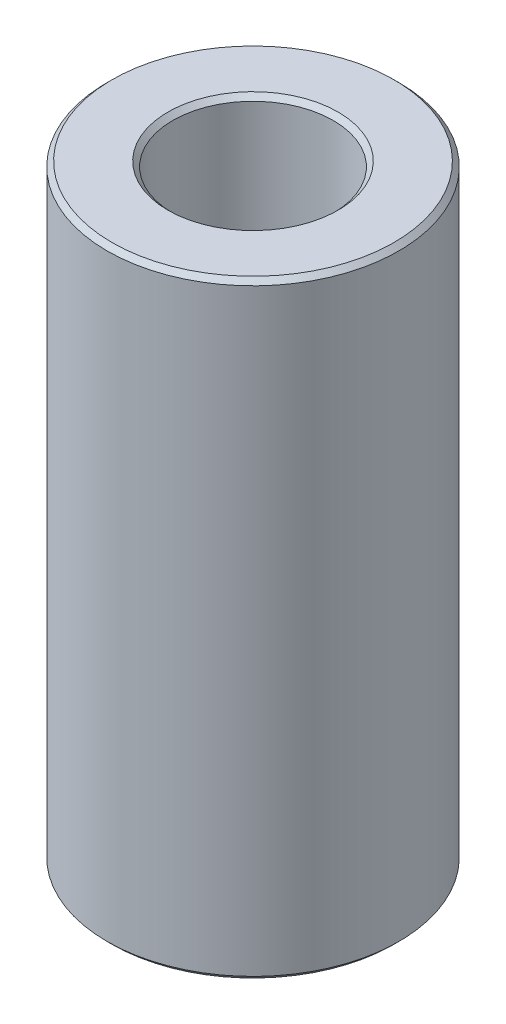
ISO-10303-21;
HEADER;
FILE_DESCRIPTION(('STEP AP214'),'2;1');
FILE_NAME('part.step','',(''),(''),'','','');
FILE_SCHEMA(('AUTOMOTIVE_DESIGN { 1 0 10303 214 1 1 1 1 }'));
ENDSEC;
DATA;
#1=APPLICATION_CONTEXT('core data for automotive mechanical design processes');
#2=APPLICATION_PROTOCOL_DEFINITION('international standard','automotive_design',2000,#1);
#3=PRODUCT_CONTEXT('',#1,'mechanical');
#4=PRODUCT('Part','Part','',(#3));
#5=PRODUCT_RELATED_PRODUCT_CATEGORY('part','',(#4));
#6=PRODUCT_DEFINITION_FORMATION('','',#4);
#7=PRODUCT_DEFINITION_CONTEXT('part definition',#1,'design');
#8=PRODUCT_DEFINITION('design','',#6,#7);
#9=PRODUCT_DEFINITION_SHAPE('','',#8);
#10=(LENGTH_UNIT() NAMED_UNIT(*) SI_UNIT(.MILLI.,.METRE.));
#11=(NAMED_UNIT(*) PLANE_ANGLE_UNIT() SI_UNIT($,.RADIAN.));
#12=(NAMED_UNIT(*) SI_UNIT($,.STERADIAN.) SOLID_ANGLE_UNIT());
#13=UNCERTAINTY_MEASURE_WITH_UNIT(LENGTH_MEASURE(1.E-05),#10,'distance_accuracy_value','');
#14=(GEOMETRIC_REPRESENTATION_CONTEXT(3) GLOBAL_UNCERTAINTY_ASSIGNED_CONTEXT((#13)) GLOBAL_UNIT_ASSIGNED_CONTEXT((#10,
#11,#12)) REPRESENTATION_CONTEXT('',''));
#15=CARTESIAN_POINT('',(0.,0.,0.));
#16=DIRECTION('',(0.,0.,1.));
#17=DIRECTION('',(1.,0.,0.));
#18=AXIS2_PLACEMENT_3D('',#15,#16,#17);
#19=CARTESIAN_POINT('',(0.,25.,0.));
#20=DIRECTION('',(0.,-1.,0.));
#21=DIRECTION('',(0.,0.,-1.));
#22=AXIS2_PLACEMENT_3D('',#19,#20,#21);
#23=CYLINDRICAL_SURFACE('',#22,6.);
#24=CARTESIAN_POINT('',(0.,0.199999999999992,0.));
#25=DIRECTION('',(0.,1.,0.));
#26=DIRECTION('',(0.,0.,1.));
#27=AXIS2_PLACEMENT_3D('',#24,#25,#26);
#28=CIRCLE('',#27,6.);
#29=CARTESIAN_POINT('',(0.,0.199999999999992,6.));
#30=VERTEX_POINT('',#29);
#31=EDGE_CURVE('E10',#30,#30,#28,.T.);
#32=ORIENTED_EDGE('',*,*,#31,.T.);
#33=EDGE_LOOP('',(#32));
#34=FACE_BOUND('',#33,.T.);
#35=CARTESIAN_POINT('',(0.,24.8,0.));
#36=DIRECTION('',(0.,1.,0.));
#37=DIRECTION('',(0.,0.,1.));
#38=AXIS2_PLACEMENT_3D('',#35,#36,#37);
#39=CIRCLE('',#38,6.);
#40=CARTESIAN_POINT('',(0.,24.8,6.));
#41=VERTEX_POINT('',#40);
#42=EDGE_CURVE('E47',#41,#41,#39,.F.);
#43=ORIENTED_EDGE('',*,*,#42,.T.);
#44=EDGE_LOOP('',(#43));
#45=FACE_BOUND('',#44,.T.);
#46=ADVANCED_FACE('F39',(#34,#45),#23,.T.);
#47=CARTESIAN_POINT('',(0.,25.,0.));
#48=DIRECTION('',(0.,1.,0.));
#49=DIRECTION('',(0.,0.,1.));
#50=AXIS2_PLACEMENT_3D('',#47,#48,#49);
#51=PLANE('',#50);
#52=CARTESIAN_POINT('',(0.,25.,0.));
#53=DIRECTION('',(0.,1.,0.));
#54=DIRECTION('',(0.,0.,1.));
#55=AXIS2_PLACEMENT_3D('',#52,#53,#54);
#56=CIRCLE('',#55,3.49999999999999);
#57=CARTESIAN_POINT('',(0.,25.,3.49999999999999));
#58=VERTEX_POINT('',#57);
#59=EDGE_CURVE('E51',#58,#58,#56,.F.);
#60=ORIENTED_EDGE('',*,*,#59,.T.);
#61=EDGE_LOOP('',(#60));
#62=FACE_BOUND('',#61,.T.);
#63=CARTESIAN_POINT('',(0.,25.,0.));
#64=DIRECTION('',(0.,1.,0.));
#65=DIRECTION('',(0.,0.,1.));
#66=AXIS2_PLACEMENT_3D('',#63,#64,#65);
#67=CIRCLE('',#66,5.8);
#68=CARTESIAN_POINT('',(0.,25.,5.8));
#69=VERTEX_POINT('',#68);
#70=EDGE_CURVE('E55',#69,#69,#67,.T.);
#71=ORIENTED_EDGE('',*,*,#70,.T.);
#72=EDGE_LOOP('',(#71));
#73=FACE_BOUND('',#72,.T.);
#74=ADVANCED_FACE('F89',(#62,#73),#51,.T.);
#75=CARTESIAN_POINT('',(0.,0.,0.));
#76=DIRECTION('',(0.,1.,0.));
#77=DIRECTION('',(0.,0.,1.));
#78=AXIS2_PLACEMENT_3D('',#75,#76,#77);
#79=PLANE('',#78);
#80=CARTESIAN_POINT('',(0.,0.,0.));
#81=DIRECTION('',(0.,1.,0.));
#82=DIRECTION('',(0.,0.,1.));
#83=AXIS2_PLACEMENT_3D('',#80,#81,#82);
#84=CIRCLE('',#83,3.5);
#85=CARTESIAN_POINT('',(0.,0.,3.5));
#86=VERTEX_POINT('',#85);
#87=EDGE_CURVE('E66',#86,#86,#84,.T.);
#88=ORIENTED_EDGE('',*,*,#87,.T.);
#89=EDGE_LOOP('',(#88));
#90=FACE_BOUND('',#89,.T.);
#91=CARTESIAN_POINT('',(0.,0.,0.));
#92=DIRECTION('',(0.,1.,0.));
#93=DIRECTION('',(0.,0.,1.));
#94=AXIS2_PLACEMENT_3D('',#91,#92,#93);
#95=CIRCLE('',#94,5.80000000000001);
#96=CARTESIAN_POINT('',(0.,0.,5.80000000000001));
#97=VERTEX_POINT('',#96);
#98=EDGE_CURVE('E69',#97,#97,#95,.F.);
#99=ORIENTED_EDGE('',*,*,#98,.T.);
#100=EDGE_LOOP('',(#99));
#101=FACE_BOUND('',#100,.T.);
#102=ADVANCED_FACE('F73',(#90,#101),#79,.F.);
#103=CARTESIAN_POINT('',(0.,25.,0.));
#104=DIRECTION('',(0.,1.,0.));
#105=DIRECTION('',(0.,0.,1.));
#106=AXIS2_PLACEMENT_3D('',#103,#104,#105);
#107=CYLINDRICAL_SURFACE('',#106,3.29999999999999);
#108=CARTESIAN_POINT('',(0.,0.200000000000006,0.));
#109=DIRECTION('',(0.,1.,0.));
#110=DIRECTION('',(0.,0.,1.));
#111=AXIS2_PLACEMENT_3D('',#108,#109,#110);
#112=CIRCLE('',#111,3.29999999999999);
#113=CARTESIAN_POINT('',(0.,0.200000000000006,3.29999999999999));
#114=VERTEX_POINT('',#113);
#115=EDGE_CURVE('E60',#114,#114,#112,.F.);
#116=ORIENTED_EDGE('',*,*,#115,.T.);
#117=EDGE_LOOP('',(#116));
#118=FACE_BOUND('',#117,.T.);
#119=CARTESIAN_POINT('',(0.,24.8,0.));
#120=DIRECTION('',(0.,1.,0.));
#121=DIRECTION('',(0.,0.,1.));
#122=AXIS2_PLACEMENT_3D('',#119,#120,#121);
#123=CIRCLE('',#122,3.29999999999999);
#124=CARTESIAN_POINT('',(0.,24.8,3.29999999999999));
#125=VERTEX_POINT('',#124);
#126=EDGE_CURVE('E63',#125,#125,#123,.T.);
#127=ORIENTED_EDGE('',*,*,#126,.T.);
#128=EDGE_LOOP('',(#127));
#129=FACE_BOUND('',#128,.T.);
#130=ADVANCED_FACE('F103',(#118,#129),#107,.F.);
#131=CARTESIAN_POINT('',(0.,0.,0.));
#132=DIRECTION('',(0.,-1.,0.));
#133=DIRECTION('',(0.,0.,-1.));
#134=AXIS2_PLACEMENT_3D('',#131,#132,#133);
#135=CONICAL_SURFACE('',#134,3.5,0.785398163397448);
#136=ORIENTED_EDGE('',*,*,#115,.F.);
#137=EDGE_LOOP('',(#136));
#138=FACE_BOUND('',#137,.T.);
#139=ORIENTED_EDGE('',*,*,#87,.F.);
#140=EDGE_LOOP('',(#139));
#141=FACE_BOUND('',#140,.T.);
#142=ADVANCED_FACE('F84',(#138,#141),#135,.F.);
#143=CARTESIAN_POINT('',(0.,24.8,0.));
#144=DIRECTION('',(0.,1.,0.));
#145=DIRECTION('',(0.,0.,1.));
#146=AXIS2_PLACEMENT_3D('',#143,#144,#145);
#147=CONICAL_SURFACE('',#146,3.29999999999999,0.785398163397448);
#148=ORIENTED_EDGE('',*,*,#59,.F.);
#149=EDGE_LOOP('',(#148));
#150=FACE_BOUND('',#149,.T.);
#151=ORIENTED_EDGE('',*,*,#126,.F.);
#152=EDGE_LOOP('',(#151));
#153=FACE_BOUND('',#152,.T.);
#154=ADVANCED_FACE('F78',(#150,#153),#147,.F.);
#155=CARTESIAN_POINT('',(0.,0.199999999999992,0.));
#156=DIRECTION('',(0.,1.,0.));
#157=DIRECTION('',(0.,0.,1.));
#158=AXIS2_PLACEMENT_3D('',#155,#156,#157);
#159=CONICAL_SURFACE('',#158,6.,0.785398163397457);
#160=ORIENTED_EDGE('',*,*,#98,.F.);
#161=EDGE_LOOP('',(#160));
#162=FACE_BOUND('',#161,.T.);
#163=ORIENTED_EDGE('',*,*,#31,.F.);
#164=EDGE_LOOP('',(#163));
#165=FACE_BOUND('',#164,.T.);
#166=ADVANCED_FACE('F75',(#162,#165),#159,.T.);
#167=CARTESIAN_POINT('',(0.,25.,0.));
#168=DIRECTION('',(0.,-1.,0.));
#169=DIRECTION('',(0.,0.,-1.));
#170=AXIS2_PLACEMENT_3D('',#167,#168,#169);
#171=CONICAL_SURFACE('',#170,5.8,0.785398163397448);
#172=ORIENTED_EDGE('',*,*,#42,.F.);
#173=EDGE_LOOP('',(#172));
#174=FACE_BOUND('',#173,.T.);
#175=ORIENTED_EDGE('',*,*,#70,.F.);
#176=EDGE_LOOP('',(#175));
#177=FACE_BOUND('',#176,.T.);
#178=ADVANCED_FACE('F42',(#174,#177),#171,.T.);
#179=CLOSED_SHELL('',(#46,#74,#102,#130,#142,#154,#166,#178));
#180=MANIFOLD_SOLID_BREP('B2',#179);
#181=ADVANCED_BREP_SHAPE_REPRESENTATION('',(#18,#180),#14);
#182=SHAPE_DEFINITION_REPRESENTATION(#9,#181);
ENDSEC;
END-ISO-10303-21;
